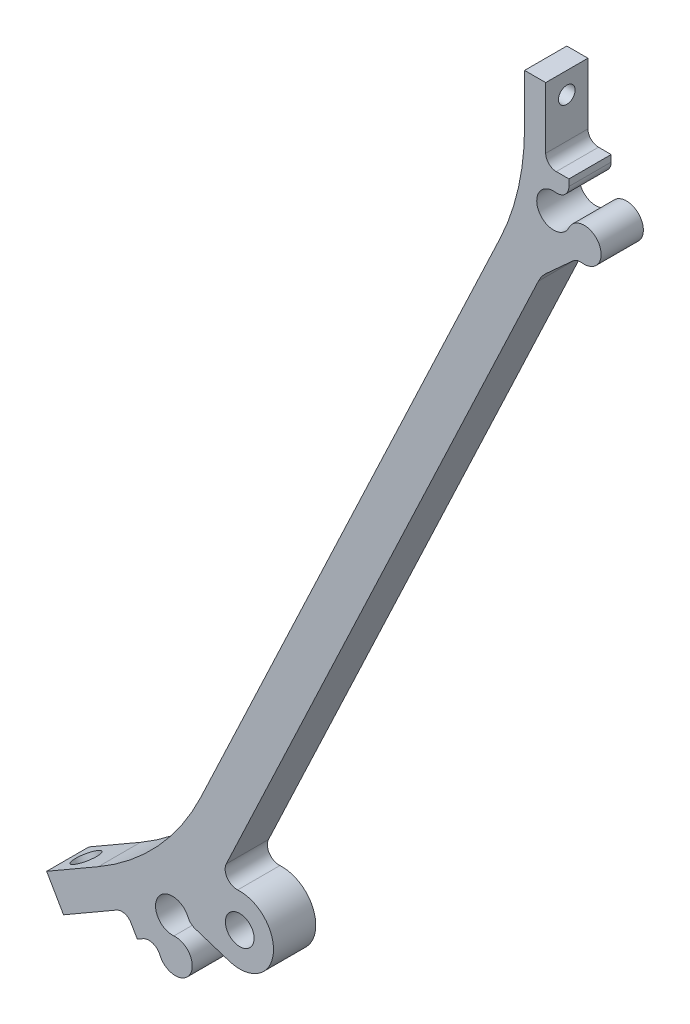
ISO-10303-21;
HEADER;
FILE_DESCRIPTION(('STEP AP214'),'2;1');
FILE_NAME('part.step','',(''),(''),'','','');
FILE_SCHEMA(('AUTOMOTIVE_DESIGN { 1 0 10303 214 1 1 1 1 }'));
ENDSEC;
DATA;
#1=APPLICATION_CONTEXT('core data for automotive mechanical design processes');
#2=APPLICATION_PROTOCOL_DEFINITION('international standard','automotive_design',2000,#1);
#3=PRODUCT_CONTEXT('',#1,'mechanical');
#4=PRODUCT('Part','Part','',(#3));
#5=PRODUCT_RELATED_PRODUCT_CATEGORY('part','',(#4));
#6=PRODUCT_DEFINITION_FORMATION('','',#4);
#7=PRODUCT_DEFINITION_CONTEXT('part definition',#1,'design');
#8=PRODUCT_DEFINITION('design','',#6,#7);
#9=PRODUCT_DEFINITION_SHAPE('','',#8);
#10=(LENGTH_UNIT() NAMED_UNIT(*) SI_UNIT(.MILLI.,.METRE.));
#11=(NAMED_UNIT(*) PLANE_ANGLE_UNIT() SI_UNIT($,.RADIAN.));
#12=(NAMED_UNIT(*) SI_UNIT($,.STERADIAN.) SOLID_ANGLE_UNIT());
#13=UNCERTAINTY_MEASURE_WITH_UNIT(LENGTH_MEASURE(1.E-05),#10,'distance_accuracy_value','');
#14=(GEOMETRIC_REPRESENTATION_CONTEXT(3) GLOBAL_UNCERTAINTY_ASSIGNED_CONTEXT((#13)) GLOBAL_UNIT_ASSIGNED_CONTEXT((#10,
#11,#12)) REPRESENTATION_CONTEXT('',''));
#15=CARTESIAN_POINT('',(0.,0.,0.));
#16=DIRECTION('',(0.,0.,1.));
#17=DIRECTION('',(1.,0.,0.));
#18=AXIS2_PLACEMENT_3D('',#15,#16,#17);
#19=CARTESIAN_POINT('',(28.6750898602138,32.7620342253304,6.35));
#20=DIRECTION('',(0.,0.,-1.));
#21=DIRECTION('',(-1.,0.,0.));
#22=AXIS2_PLACEMENT_3D('',#19,#20,#21);
#23=PLANE('',#22);
#24=DIRECTION('',(0.499999999999981,-0.866025403784449,0.));
#25=VECTOR('',#24,1.);
#26=CARTESIAN_POINT('',(13.2947222605792,35.8339027739446,6.35));
#27=LINE('',#26,#25);
#28=CARTESIAN_POINT('',(13.2947222605792,35.8339027739446,6.35));
#29=VERTEX_POINT('',#28);
#30=CARTESIAN_POINT('',(15.8347222605791,31.4344937227196,6.35));
#31=VERTEX_POINT('',#30);
#32=EDGE_CURVE('E236',#29,#31,#27,.T.);
#33=ORIENTED_EDGE('',*,*,#32,.T.);
#34=DIRECTION('',(0.86602540378445,0.499999999999981,0.));
#35=VECTOR('',#34,1.);
#36=CARTESIAN_POINT('',(15.8347222605791,31.4344937227196,6.35));
#37=LINE('',#36,#35);
#38=CARTESIAN_POINT('',(23.8086511659251,36.0382437227198,6.35));
#39=VERTEX_POINT('',#38);
#40=EDGE_CURVE('E225',#31,#39,#37,.T.);
#41=ORIENTED_EDGE('',*,*,#40,.T.);
#42=CARTESIAN_POINT('',(24.602401165925,34.663428394212,6.35));
#43=DIRECTION('',(0.,0.,-1.));
#44=DIRECTION('',(-1.,0.,0.));
#45=AXIS2_PLACEMENT_3D('',#42,#43,#44);
#46=CIRCLE('',#45,1.5875);
#47=CARTESIAN_POINT('',(25.9772164944332,35.4571783942114,6.35));
#48=VERTEX_POINT('',#47);
#49=EDGE_CURVE('E272',#39,#48,#46,.T.);
#50=ORIENTED_EDGE('',*,*,#49,.T.);
#51=DIRECTION('',(0.499999999999635,-0.866025403784649,0.));
#52=VECTOR('',#51,1.);
#53=CARTESIAN_POINT('',(25.1834664944334,36.8319937227201,6.35));
#54=LINE('',#53,#52);
#55=CARTESIAN_POINT('',(26.9297164944322,33.807400000002,6.35));
#56=VERTEX_POINT('',#55);
#57=EDGE_CURVE('E235',#48,#56,#54,.T.);
#58=ORIENTED_EDGE('',*,*,#57,.T.);
#59=DIRECTION('',(0.866025403784449,0.499999999999982,0.));
#60=VECTOR('',#59,1.);
#61=CARTESIAN_POINT('',(26.9297164944322,33.807400000002,6.35));
#62=LINE('',#61,#60);
#63=CARTESIAN_POINT('',(27.7860898602124,34.301827393262,6.35));
#64=VERTEX_POINT('',#63);
#65=EDGE_CURVE('E858',#56,#64,#62,.T.);
#66=ORIENTED_EDGE('',*,*,#65,.T.);
#67=CARTESIAN_POINT('',(28.6750898602138,32.7620342253304,6.35));
#68=DIRECTION('',(0.,0.,-1.));
#69=DIRECTION('',(-1.,0.,0.));
#70=AXIS2_PLACEMENT_3D('',#67,#68,#69);
#71=CIRCLE('',#70,1.77800000000325);
#72=CARTESIAN_POINT('',(30.3112736731325,33.45786935692,6.35));
#73=VERTEX_POINT('',#72);
#74=EDGE_CURVE('E418',#64,#73,#71,.T.);
#75=ORIENTED_EDGE('',*,*,#74,.T.);
#76=CARTESIAN_POINT('',(32.6486791201546,34.451919544903,6.35));
#77=DIRECTION('',(0.,0.,1.));
#78=DIRECTION('',(1.,0.,0.));
#79=AXIS2_PLACEMENT_3D('',#76,#77,#78);
#80=CIRCLE('',#79,2.53999999999941);
#81=CARTESIAN_POINT('',(32.4289778084637,36.982400000002,6.35));
#82=VERTEX_POINT('',#81);
#83=EDGE_CURVE('E437',#73,#82,#80,.T.);
#84=ORIENTED_EDGE('',*,*,#83,.T.);
#85=CARTESIAN_POINT('',(32.2092764967728,39.5128804551011,6.35));
#86=DIRECTION('',(0.,0.,-1.));
#87=DIRECTION('',(1.,0.,0.));
#88=AXIS2_PLACEMENT_3D('',#85,#86,#87);
#89=CIRCLE('',#88,2.53999999999941);
#90=CARTESIAN_POINT('',(34.5466819437948,40.5069306430841,6.35));
#91=VERTEX_POINT('',#90);
#92=EDGE_CURVE('E434',#82,#91,#89,.T.);
#93=ORIENTED_EDGE('',*,*,#92,.T.);
#94=CARTESIAN_POINT('',(36.1828657567133,41.2027657746735,6.35));
#95=DIRECTION('',(0.,0.,1.));
#96=DIRECTION('',(1.,0.,0.));
#97=AXIS2_PLACEMENT_3D('',#94,#95,#96);
#98=CIRCLE('',#97,1.77800000000308);
#99=CARTESIAN_POINT('',(35.6391876912389,39.5099284637859,6.35));
#100=VERTEX_POINT('',#99);
#101=EDGE_CURVE('E436',#91,#100,#98,.T.);
#102=ORIENTED_EDGE('',*,*,#101,.T.);
#103=DIRECTION('',(0.952101974625759,-0.305780689242684,0.));
#104=VECTOR('',#103,1.);
#105=CARTESIAN_POINT('',(35.6391876912389,39.5099284637859,6.35));
#106=LINE('',#105,#104);
#107=CARTESIAN_POINT('',(40.774282272367,37.8607219689029,6.35));
#108=VERTEX_POINT('',#107);
#109=EDGE_CURVE('E439',#100,#108,#106,.T.);
#110=ORIENTED_EDGE('',*,*,#109,.T.);
#111=CARTESIAN_POINT('',(42.3276481737198,42.6974000000017,6.35));
#112=DIRECTION('',(0.,0.,1.));
#113=DIRECTION('',(1.,0.,0.));
#114=AXIS2_PLACEMENT_3D('',#111,#112,#113);
#115=CIRCLE('',#114,5.08000000000002);
#116=CARTESIAN_POINT('',(42.0177686217037,47.7679398788748,6.35));
#117=VERTEX_POINT('',#116);
#118=EDGE_CURVE('E445',#108,#117,#115,.T.);
#119=ORIENTED_EDGE('',*,*,#118,.T.);
#120=CARTESIAN_POINT('',(41.909310778498,49.5426288364804,6.35));
#121=DIRECTION('',(0.,0.,-1.));
#122=DIRECTION('',(1.,0.,0.));
#123=AXIS2_PLACEMENT_3D('',#120,#121,#122);
#124=CIRCLE('',#123,1.778);
#125=CARTESIAN_POINT('',(40.301653081639,50.302050148882,6.35));
#126=VERTEX_POINT('',#125);
#127=EDGE_CURVE('E447',#117,#126,#124,.T.);
#128=ORIENTED_EDGE('',*,*,#127,.T.);
#129=DIRECTION('',(0.427121098088627,0.904194430179464,0.));
#130=VECTOR('',#129,1.);
#131=CARTESIAN_POINT('',(40.301653081639,50.302050148882,6.35));
#132=LINE('',#131,#130);
#133=CARTESIAN_POINT('',(87.2276922946883,149.64217517829,6.35));
#134=VERTEX_POINT('',#133);
#135=EDGE_CURVE('E449',#126,#134,#132,.T.);
#136=ORIENTED_EDGE('',*,*,#135,.T.);
#137=CARTESIAN_POINT('',(91.821,147.4724,6.35));
#138=DIRECTION('',(0.,0.,-1.));
#139=DIRECTION('',(-1.,0.,0.));
#140=AXIS2_PLACEMENT_3D('',#137,#138,#139);
#141=CIRCLE('',#140,5.07999999999999);
#142=CARTESIAN_POINT('',(88.4089969058181,151.235993347493,6.35));
#143=VERTEX_POINT('',#142);
#144=EDGE_CURVE('E451',#134,#143,#141,.T.);
#145=ORIENTED_EDGE('',*,*,#144,.T.);
#146=DIRECTION('',(0.740864832183645,0.671654152398018,0.));
#147=VECTOR('',#146,1.);
#148=CARTESIAN_POINT('',(92.4047989170363,154.858512458145,6.35));
#149=LINE('',#148,#147);
#150=CARTESIAN_POINT('',(92.4047989170363,154.858512458145,6.35));
#151=VERTEX_POINT('',#150);
#152=EDGE_CURVE('E453',#143,#151,#149,.T.);
#153=ORIENTED_EDGE('',*,*,#152,.T.);
#154=CARTESIAN_POINT('',(93.599,153.541254786522,6.35));
#155=DIRECTION('',(0.,0.,-1.));
#156=DIRECTION('',(1.,0.,0.));
#157=AXIS2_PLACEMENT_3D('',#154,#155,#156);
#158=CIRCLE('',#157,1.77800000000003);
#159=CARTESIAN_POINT('',(93.814481005658,155.306149099562,6.35));
#160=VERTEX_POINT('',#159);
#161=EDGE_CURVE('E455',#151,#160,#158,.T.);
#162=ORIENTED_EDGE('',*,*,#161,.T.);
#163=CARTESIAN_POINT('',(94.1223110137408,157.827426689619,6.35));
#164=DIRECTION('',(0.,0.,1.));
#165=DIRECTION('',(1.,0.,0.));
#166=AXIS2_PLACEMENT_3D('',#163,#164,#165);
#167=CIRCLE('',#166,2.53999999999943);
#168=CARTESIAN_POINT('',(91.821,158.9024,6.35));
#169=VERTEX_POINT('',#168);
#170=EDGE_CURVE('E457',#160,#169,#167,.T.);
#171=ORIENTED_EDGE('',*,*,#170,.T.);
#172=CARTESIAN_POINT('',(89.5196889862593,159.977373310381,6.35));
#173=DIRECTION('',(0.,0.,-1.));
#174=DIRECTION('',(1.,0.,0.));
#175=AXIS2_PLACEMENT_3D('',#172,#173,#174);
#176=CIRCLE('',#175,2.5399999999994);
#177=CARTESIAN_POINT('',(89.827518994342,162.498650900438,6.35));
#178=VERTEX_POINT('',#177);
#179=EDGE_CURVE('E459',#169,#178,#176,.T.);
#180=ORIENTED_EDGE('',*,*,#179,.T.);
#181=CARTESIAN_POINT('',(90.043,164.263545213478,6.35));
#182=DIRECTION('',(0.,0.,1.));
#183=DIRECTION('',(-1.,0.,0.));
#184=AXIS2_PLACEMENT_3D('',#181,#182,#183);
#185=CIRCLE('',#184,1.778);
#186=CARTESIAN_POINT('',(91.821,164.263545213478,6.35));
#187=VERTEX_POINT('',#186);
#188=EDGE_CURVE('E461',#178,#187,#185,.T.);
#189=ORIENTED_EDGE('',*,*,#188,.T.);
#190=DIRECTION('',(0.,1.,0.));
#191=VECTOR('',#190,1.);
#192=CARTESIAN_POINT('',(91.821,165.2524,6.35));
#193=LINE('',#192,#191);
#194=CARTESIAN_POINT('',(91.821,165.2524,6.35));
#195=VERTEX_POINT('',#194);
#196=EDGE_CURVE('E463',#187,#195,#193,.T.);
#197=ORIENTED_EDGE('',*,*,#196,.T.);
#198=DIRECTION('',(-1.,0.,0.));
#199=VECTOR('',#198,1.);
#200=CARTESIAN_POINT('',(91.821,165.2524,6.35));
#201=LINE('',#200,#199);
#202=CARTESIAN_POINT('',(89.916,165.2524,6.35));
#203=VERTEX_POINT('',#202);
#204=EDGE_CURVE('E465',#195,#203,#201,.T.);
#205=ORIENTED_EDGE('',*,*,#204,.T.);
#206=CARTESIAN_POINT('',(89.916,166.8399,6.35));
#207=DIRECTION('',(0.,0.,-1.));
#208=DIRECTION('',(-1.,0.,0.));
#209=AXIS2_PLACEMENT_3D('',#206,#207,#208);
#210=CIRCLE('',#209,1.5875);
#211=CARTESIAN_POINT('',(88.3285,166.8399,6.35));
#212=VERTEX_POINT('',#211);
#213=EDGE_CURVE('E276',#203,#212,#210,.T.);
#214=ORIENTED_EDGE('',*,*,#213,.T.);
#215=DIRECTION('',(0.,1.,0.));
#216=VECTOR('',#215,1.);
#217=CARTESIAN_POINT('',(88.3285,165.2524,6.35));
#218=LINE('',#217,#216);
#219=CARTESIAN_POINT('',(88.3285,176.0474,6.35));
#220=VERTEX_POINT('',#219);
#221=EDGE_CURVE('E468',#212,#220,#218,.T.);
#222=ORIENTED_EDGE('',*,*,#221,.T.);
#223=DIRECTION('',(-1.,0.,0.));
#224=VECTOR('',#223,1.);
#225=CARTESIAN_POINT('',(88.3285,176.0474,6.35));
#226=LINE('',#225,#224);
#227=CARTESIAN_POINT('',(85.1535,176.0474,6.35));
#228=VERTEX_POINT('',#227);
#229=EDGE_CURVE('E470',#220,#228,#226,.T.);
#230=ORIENTED_EDGE('',*,*,#229,.T.);
#231=DIRECTION('',(0.,-1.,0.));
#232=VECTOR('',#231,1.);
#233=CARTESIAN_POINT('',(85.1535,176.0474,6.35));
#234=LINE('',#233,#232);
#235=CARTESIAN_POINT('',(85.1535,168.664225661262,6.35));
#236=VERTEX_POINT('',#235);
#237=EDGE_CURVE('E310',#228,#236,#234,.T.);
#238=ORIENTED_EDGE('',*,*,#237,.T.);
#239=CARTESIAN_POINT('',(47.0535,168.664225661262,6.35));
#240=DIRECTION('',(0.,0.,-1.));
#241=DIRECTION('',(-1.,0.,0.));
#242=AXIS2_PLACEMENT_3D('',#239,#240,#241);
#243=CIRCLE('',#242,38.1);
#244=CARTESIAN_POINT('',(81.5033077898376,152.390911824085,6.35));
#245=VERTEX_POINT('',#244);
#246=EDGE_CURVE('E289',#236,#245,#243,.T.);
#247=ORIENTED_EDGE('',*,*,#246,.T.);
#248=DIRECTION('',(-0.427121098088627,-0.904194430179464,0.));
#249=VECTOR('',#248,1.);
#250=CARTESIAN_POINT('',(85.1535,160.118189826233,6.35));
#251=LINE('',#250,#249);
#252=CARTESIAN_POINT('',(36.4620239321402,57.0407215044967,6.35));
#253=VERTEX_POINT('',#252);
#254=EDGE_CURVE('E306',#245,#253,#251,.T.);
#255=ORIENTED_EDGE('',*,*,#254,.T.);
#256=CARTESIAN_POINT('',(2.01221614230267,73.3140353416733,6.35));
#257=DIRECTION('',(0.,0.,-1.));
#258=DIRECTION('',(-1.,0.,0.));
#259=AXIS2_PLACEMENT_3D('',#256,#257,#258);
#260=CIRCLE('',#259,38.1);
#261=CARTESIAN_POINT('',(21.062216142302,40.3184674574858,6.35));
#262=VERTEX_POINT('',#261);
#263=EDGE_CURVE('E11',#253,#262,#260,.T.);
#264=ORIENTED_EDGE('',*,*,#263,.T.);
#265=DIRECTION('',(-0.866025403784449,-0.499999999999981,0.));
#266=VECTOR('',#265,1.);
#267=CARTESIAN_POINT('',(31.375529243393,46.2728615526373,6.35));
#268=LINE('',#267,#266);
#269=EDGE_CURVE('E240',#262,#29,#268,.T.);
#270=ORIENTED_EDGE('',*,*,#269,.T.);
#271=EDGE_LOOP('',(#33,#41,#50,#58,#66,#75,#84,#93,#102,#110,#119,#128,#136,#145,#153,#162,#171,
#180,#189,#197,#205,#214,#222,#230,#238,#247,#255,#264,#270));
#272=FACE_BOUND('',#271,.T.);
#273=CARTESIAN_POINT('',(42.3276481737198,42.6974000000017,6.35));
#274=DIRECTION('',(0.,0.,1.));
#275=DIRECTION('',(1.,0.,0.));
#276=AXIS2_PLACEMENT_3D('',#273,#274,#275);
#277=CIRCLE('',#276,2.159);
#278=CARTESIAN_POINT('',(44.4866481737198,42.6974000000017,6.35));
#279=VERTEX_POINT('',#278);
#280=EDGE_CURVE('E316',#279,#279,#277,.T.);
#281=ORIENTED_EDGE('',*,*,#280,.F.);
#282=EDGE_LOOP('',(#281));
#283=FACE_BOUND('',#282,.T.);
#284=ADVANCED_FACE('F35',(#272,#283),#23,.F.);
#285=CARTESIAN_POINT('',(28.6750898602138,32.7620342253304,0.));
#286=DIRECTION('',(0.,0.,-1.));
#287=DIRECTION('',(-1.,0.,0.));
#288=AXIS2_PLACEMENT_3D('',#285,#286,#287);
#289=PLANE('',#288);
#290=DIRECTION('',(0.499999999999981,-0.866025403784449,0.));
#291=VECTOR('',#290,1.);
#292=CARTESIAN_POINT('',(13.2947222605792,35.8339027739446,0.));
#293=LINE('',#292,#291);
#294=CARTESIAN_POINT('',(13.2947222605792,35.8339027739446,0.));
#295=VERTEX_POINT('',#294);
#296=CARTESIAN_POINT('',(15.8347222605791,31.4344937227196,0.));
#297=VERTEX_POINT('',#296);
#298=EDGE_CURVE('E248',#295,#297,#293,.T.);
#299=ORIENTED_EDGE('',*,*,#298,.F.);
#300=DIRECTION('',(-0.866025403784449,-0.499999999999981,0.));
#301=VECTOR('',#300,1.);
#302=CARTESIAN_POINT('',(31.375529243393,46.2728615526373,0.));
#303=LINE('',#302,#301);
#304=CARTESIAN_POINT('',(21.062216142302,40.3184674574858,0.));
#305=VERTEX_POINT('',#304);
#306=EDGE_CURVE('E244',#305,#295,#303,.T.);
#307=ORIENTED_EDGE('',*,*,#306,.F.);
#308=CARTESIAN_POINT('',(2.01221614230267,73.3140353416733,0.));
#309=DIRECTION('',(0.,0.,-1.));
#310=DIRECTION('',(-1.,0.,0.));
#311=AXIS2_PLACEMENT_3D('',#308,#309,#310);
#312=CIRCLE('',#311,38.1);
#313=CARTESIAN_POINT('',(36.4620239321402,57.0407215044967,0.));
#314=VERTEX_POINT('',#313);
#315=EDGE_CURVE('E43',#305,#314,#312,.F.);
#316=ORIENTED_EDGE('',*,*,#315,.T.);
#317=DIRECTION('',(-0.427121098088627,-0.904194430179464,0.));
#318=VECTOR('',#317,1.);
#319=CARTESIAN_POINT('',(85.1535,160.118189826233,0.));
#320=LINE('',#319,#318);
#321=CARTESIAN_POINT('',(81.5033077898376,152.390911824085,0.));
#322=VERTEX_POINT('',#321);
#323=EDGE_CURVE('E296',#322,#314,#320,.T.);
#324=ORIENTED_EDGE('',*,*,#323,.F.);
#325=CARTESIAN_POINT('',(47.0535,168.664225661262,0.));
#326=DIRECTION('',(0.,0.,-1.));
#327=DIRECTION('',(-1.,0.,0.));
#328=AXIS2_PLACEMENT_3D('',#325,#326,#327);
#329=CIRCLE('',#328,38.1);
#330=CARTESIAN_POINT('',(85.1535,168.664225661262,0.));
#331=VERTEX_POINT('',#330);
#332=EDGE_CURVE('E287',#322,#331,#329,.F.);
#333=ORIENTED_EDGE('',*,*,#332,.T.);
#334=DIRECTION('',(0.,-1.,0.));
#335=VECTOR('',#334,1.);
#336=CARTESIAN_POINT('',(85.1535,176.0474,0.));
#337=LINE('',#336,#335);
#338=CARTESIAN_POINT('',(85.1535,176.0474,0.));
#339=VERTEX_POINT('',#338);
#340=EDGE_CURVE('E301',#339,#331,#337,.T.);
#341=ORIENTED_EDGE('',*,*,#340,.F.);
#342=DIRECTION('',(-1.,0.,0.));
#343=VECTOR('',#342,1.);
#344=CARTESIAN_POINT('',(88.3285,176.0474,0.));
#345=LINE('',#344,#343);
#346=CARTESIAN_POINT('',(88.3285,176.0474,0.));
#347=VERTEX_POINT('',#346);
#348=EDGE_CURVE('E357',#347,#339,#345,.T.);
#349=ORIENTED_EDGE('',*,*,#348,.F.);
#350=DIRECTION('',(0.,1.,0.));
#351=VECTOR('',#350,1.);
#352=CARTESIAN_POINT('',(88.3285,165.2524,0.));
#353=LINE('',#352,#351);
#354=CARTESIAN_POINT('',(88.3285,166.8399,0.));
#355=VERTEX_POINT('',#354);
#356=EDGE_CURVE('E355',#355,#347,#353,.T.);
#357=ORIENTED_EDGE('',*,*,#356,.F.);
#358=CARTESIAN_POINT('',(89.916,166.8399,0.));
#359=DIRECTION('',(0.,0.,-1.));
#360=DIRECTION('',(-1.,0.,0.));
#361=AXIS2_PLACEMENT_3D('',#358,#359,#360);
#362=CIRCLE('',#361,1.5875);
#363=CARTESIAN_POINT('',(89.916,165.2524,0.));
#364=VERTEX_POINT('',#363);
#365=EDGE_CURVE('E274',#355,#364,#362,.F.);
#366=ORIENTED_EDGE('',*,*,#365,.T.);
#367=DIRECTION('',(-1.,0.,0.));
#368=VECTOR('',#367,1.);
#369=CARTESIAN_POINT('',(91.821,165.2524,0.));
#370=LINE('',#369,#368);
#371=CARTESIAN_POINT('',(91.821,165.2524,0.));
#372=VERTEX_POINT('',#371);
#373=EDGE_CURVE('E352',#372,#364,#370,.T.);
#374=ORIENTED_EDGE('',*,*,#373,.F.);
#375=DIRECTION('',(0.,1.,0.));
#376=VECTOR('',#375,1.);
#377=CARTESIAN_POINT('',(91.821,165.2524,0.));
#378=LINE('',#377,#376);
#379=CARTESIAN_POINT('',(91.821,164.263545213478,0.));
#380=VERTEX_POINT('',#379);
#381=EDGE_CURVE('E350',#380,#372,#378,.T.);
#382=ORIENTED_EDGE('',*,*,#381,.F.);
#383=CARTESIAN_POINT('',(90.043,164.263545213478,0.));
#384=DIRECTION('',(0.,0.,1.));
#385=DIRECTION('',(-1.,0.,0.));
#386=AXIS2_PLACEMENT_3D('',#383,#384,#385);
#387=CIRCLE('',#386,1.778);
#388=CARTESIAN_POINT('',(89.827518994342,162.498650900438,0.));
#389=VERTEX_POINT('',#388);
#390=EDGE_CURVE('E348',#389,#380,#387,.T.);
#391=ORIENTED_EDGE('',*,*,#390,.F.);
#392=CARTESIAN_POINT('',(89.5196889862593,159.977373310381,0.));
#393=DIRECTION('',(0.,0.,-1.));
#394=DIRECTION('',(1.,0.,0.));
#395=AXIS2_PLACEMENT_3D('',#392,#393,#394);
#396=CIRCLE('',#395,2.5399999999994);
#397=CARTESIAN_POINT('',(91.821,158.9024,0.));
#398=VERTEX_POINT('',#397);
#399=EDGE_CURVE('E346',#398,#389,#396,.T.);
#400=ORIENTED_EDGE('',*,*,#399,.F.);
#401=CARTESIAN_POINT('',(94.1223110137408,157.827426689619,0.));
#402=DIRECTION('',(0.,0.,1.));
#403=DIRECTION('',(1.,0.,0.));
#404=AXIS2_PLACEMENT_3D('',#401,#402,#403);
#405=CIRCLE('',#404,2.53999999999943);
#406=CARTESIAN_POINT('',(93.814481005658,155.306149099562,0.));
#407=VERTEX_POINT('',#406);
#408=EDGE_CURVE('E344',#407,#398,#405,.T.);
#409=ORIENTED_EDGE('',*,*,#408,.F.);
#410=CARTESIAN_POINT('',(93.599,153.541254786522,0.));
#411=DIRECTION('',(0.,0.,-1.));
#412=DIRECTION('',(1.,0.,0.));
#413=AXIS2_PLACEMENT_3D('',#410,#411,#412);
#414=CIRCLE('',#413,1.77800000000003);
#415=CARTESIAN_POINT('',(92.4047989170363,154.858512458145,0.));
#416=VERTEX_POINT('',#415);
#417=EDGE_CURVE('E342',#416,#407,#414,.T.);
#418=ORIENTED_EDGE('',*,*,#417,.F.);
#419=DIRECTION('',(0.740864832183645,0.671654152398018,0.));
#420=VECTOR('',#419,1.);
#421=CARTESIAN_POINT('',(92.4047989170363,154.858512458145,0.));
#422=LINE('',#421,#420);
#423=CARTESIAN_POINT('',(88.4089969058181,151.235993347493,0.));
#424=VERTEX_POINT('',#423);
#425=EDGE_CURVE('E340',#424,#416,#422,.T.);
#426=ORIENTED_EDGE('',*,*,#425,.F.);
#427=CARTESIAN_POINT('',(91.821,147.4724,0.));
#428=DIRECTION('',(0.,0.,-1.));
#429=DIRECTION('',(-1.,0.,0.));
#430=AXIS2_PLACEMENT_3D('',#427,#428,#429);
#431=CIRCLE('',#430,5.07999999999999);
#432=CARTESIAN_POINT('',(87.2276922946883,149.64217517829,0.));
#433=VERTEX_POINT('',#432);
#434=EDGE_CURVE('E338',#433,#424,#431,.T.);
#435=ORIENTED_EDGE('',*,*,#434,.F.);
#436=DIRECTION('',(0.427121098088627,0.904194430179464,0.));
#437=VECTOR('',#436,1.);
#438=CARTESIAN_POINT('',(40.301653081639,50.302050148882,0.));
#439=LINE('',#438,#437);
#440=CARTESIAN_POINT('',(40.301653081639,50.302050148882,0.));
#441=VERTEX_POINT('',#440);
#442=EDGE_CURVE('E336',#441,#433,#439,.T.);
#443=ORIENTED_EDGE('',*,*,#442,.F.);
#444=CARTESIAN_POINT('',(41.909310778498,49.5426288364804,0.));
#445=DIRECTION('',(0.,0.,-1.));
#446=DIRECTION('',(1.,0.,0.));
#447=AXIS2_PLACEMENT_3D('',#444,#445,#446);
#448=CIRCLE('',#447,1.778);
#449=CARTESIAN_POINT('',(42.0177686217037,47.7679398788748,0.));
#450=VERTEX_POINT('',#449);
#451=EDGE_CURVE('E334',#450,#441,#448,.T.);
#452=ORIENTED_EDGE('',*,*,#451,.F.);
#453=CARTESIAN_POINT('',(42.3276481737198,42.6974000000017,0.));
#454=DIRECTION('',(0.,0.,1.));
#455=DIRECTION('',(1.,0.,0.));
#456=AXIS2_PLACEMENT_3D('',#453,#454,#455);
#457=CIRCLE('',#456,5.08000000000002);
#458=CARTESIAN_POINT('',(40.774282272367,37.8607219689029,0.));
#459=VERTEX_POINT('',#458);
#460=EDGE_CURVE('E332',#459,#450,#457,.T.);
#461=ORIENTED_EDGE('',*,*,#460,.F.);
#462=DIRECTION('',(0.952101974625759,-0.305780689242684,0.));
#463=VECTOR('',#462,1.);
#464=CARTESIAN_POINT('',(35.6391876912389,39.5099284637859,0.));
#465=LINE('',#464,#463);
#466=CARTESIAN_POINT('',(35.6391876912389,39.5099284637859,0.));
#467=VERTEX_POINT('',#466);
#468=EDGE_CURVE('E330',#467,#459,#465,.T.);
#469=ORIENTED_EDGE('',*,*,#468,.F.);
#470=CARTESIAN_POINT('',(36.1828657567133,41.2027657746735,0.));
#471=DIRECTION('',(0.,0.,1.));
#472=DIRECTION('',(1.,0.,0.));
#473=AXIS2_PLACEMENT_3D('',#470,#471,#472);
#474=CIRCLE('',#473,1.77800000000308);
#475=CARTESIAN_POINT('',(34.5466819437948,40.5069306430841,0.));
#476=VERTEX_POINT('',#475);
#477=EDGE_CURVE('E328',#476,#467,#474,.T.);
#478=ORIENTED_EDGE('',*,*,#477,.F.);
#479=CARTESIAN_POINT('',(32.2092764967728,39.5128804551011,0.));
#480=DIRECTION('',(0.,0.,-1.));
#481=DIRECTION('',(1.,0.,0.));
#482=AXIS2_PLACEMENT_3D('',#479,#480,#481);
#483=CIRCLE('',#482,2.53999999999941);
#484=CARTESIAN_POINT('',(32.4289778084637,36.982400000002,0.));
#485=VERTEX_POINT('',#484);
#486=EDGE_CURVE('E326',#485,#476,#483,.T.);
#487=ORIENTED_EDGE('',*,*,#486,.F.);
#488=CARTESIAN_POINT('',(32.6486791201546,34.451919544903,0.));
#489=DIRECTION('',(0.,0.,1.));
#490=DIRECTION('',(1.,0.,0.));
#491=AXIS2_PLACEMENT_3D('',#488,#489,#490);
#492=CIRCLE('',#491,2.53999999999941);
#493=CARTESIAN_POINT('',(30.3112736731325,33.45786935692,0.));
#494=VERTEX_POINT('',#493);
#495=EDGE_CURVE('E324',#494,#485,#492,.T.);
#496=ORIENTED_EDGE('',*,*,#495,.F.);
#497=CARTESIAN_POINT('',(28.6750898602138,32.7620342253304,0.));
#498=DIRECTION('',(0.,0.,-1.));
#499=DIRECTION('',(-1.,0.,0.));
#500=AXIS2_PLACEMENT_3D('',#497,#498,#499);
#501=CIRCLE('',#500,1.77800000000325);
#502=CARTESIAN_POINT('',(27.7860898602124,34.301827393262,0.));
#503=VERTEX_POINT('',#502);
#504=EDGE_CURVE('E322',#503,#494,#501,.T.);
#505=ORIENTED_EDGE('',*,*,#504,.F.);
#506=DIRECTION('',(0.866025403784449,0.499999999999982,0.));
#507=VECTOR('',#506,1.);
#508=CARTESIAN_POINT('',(26.9297164944322,33.807400000002,0.));
#509=LINE('',#508,#507);
#510=CARTESIAN_POINT('',(26.9297164944322,33.807400000002,0.));
#511=VERTEX_POINT('',#510);
#512=EDGE_CURVE('E320',#511,#503,#509,.T.);
#513=ORIENTED_EDGE('',*,*,#512,.F.);
#514=DIRECTION('',(0.499999999999635,-0.866025403784649,0.));
#515=VECTOR('',#514,1.);
#516=CARTESIAN_POINT('',(25.1834664944334,36.8319937227201,0.));
#517=LINE('',#516,#515);
#518=CARTESIAN_POINT('',(25.9772164944332,35.4571783942114,0.));
#519=VERTEX_POINT('',#518);
#520=EDGE_CURVE('E318',#519,#511,#517,.T.);
#521=ORIENTED_EDGE('',*,*,#520,.F.);
#522=CARTESIAN_POINT('',(24.602401165925,34.663428394212,0.));
#523=DIRECTION('',(0.,0.,-1.));
#524=DIRECTION('',(-1.,0.,0.));
#525=AXIS2_PLACEMENT_3D('',#522,#523,#524);
#526=CIRCLE('',#525,1.5875);
#527=CARTESIAN_POINT('',(23.8086511659251,36.0382437227198,0.));
#528=VERTEX_POINT('',#527);
#529=EDGE_CURVE('E270',#519,#528,#526,.F.);
#530=ORIENTED_EDGE('',*,*,#529,.T.);
#531=DIRECTION('',(0.86602540378445,0.499999999999981,0.));
#532=VECTOR('',#531,1.);
#533=CARTESIAN_POINT('',(15.8347222605791,31.4344937227196,0.));
#534=LINE('',#533,#532);
#535=EDGE_CURVE('E315',#297,#528,#534,.T.);
#536=ORIENTED_EDGE('',*,*,#535,.F.);
#537=EDGE_LOOP('',(#299,#307,#316,#324,#333,#341,#349,#357,#366,#374,#382,#391,#400,#409,#418,
#426,#435,#443,#452,#461,#469,#478,#487,#496,#505,#513,#521,#530,#536));
#538=FACE_BOUND('',#537,.T.);
#539=CARTESIAN_POINT('',(42.3276481737198,42.6974000000017,0.));
#540=DIRECTION('',(0.,0.,1.));
#541=DIRECTION('',(1.,0.,0.));
#542=AXIS2_PLACEMENT_3D('',#539,#540,#541);
#543=CIRCLE('',#542,2.159);
#544=CARTESIAN_POINT('',(44.4866481737198,42.6974000000017,0.));
#545=VERTEX_POINT('',#544);
#546=EDGE_CURVE('E261',#545,#545,#543,.T.);
#547=ORIENTED_EDGE('',*,*,#546,.T.);
#548=EDGE_LOOP('',(#547));
#549=FACE_BOUND('',#548,.T.);
#550=ADVANCED_FACE('F294',(#538,#549),#289,.T.);
#551=CARTESIAN_POINT('',(13.2947222605792,35.8339027739446,6.35));
#552=DIRECTION('',(0.866025403784449,0.499999999999981,0.));
#553=DIRECTION('',(-0.499999999999981,0.866025403784449,0.));
#554=AXIS2_PLACEMENT_3D('',#551,#552,#553);
#555=PLANE('',#554);
#556=ORIENTED_EDGE('',*,*,#298,.T.);
#557=DIRECTION('',(0.,0.,-1.));
#558=VECTOR('',#557,1.);
#559=CARTESIAN_POINT('',(15.8347222605791,31.4344937227196,6.35));
#560=LINE('',#559,#558);
#561=EDGE_CURVE('E230',#31,#297,#560,.T.);
#562=ORIENTED_EDGE('',*,*,#561,.F.);
#563=ORIENTED_EDGE('',*,*,#32,.F.);
#564=DIRECTION('',(0.,0.,-1.));
#565=VECTOR('',#564,1.);
#566=CARTESIAN_POINT('',(13.2947222605792,35.8339027739446,6.35));
#567=LINE('',#566,#565);
#568=EDGE_CURVE('E305',#29,#295,#567,.T.);
#569=ORIENTED_EDGE('',*,*,#568,.T.);
#570=EDGE_LOOP('',(#556,#562,#563,#569));
#571=FACE_BOUND('',#570,.T.);
#572=ADVANCED_FACE('F246',(#571),#555,.F.);
#573=CARTESIAN_POINT('',(15.8347222605791,31.4344937227196,6.35));
#574=DIRECTION('',(-0.499999999999981,0.866025403784449,0.));
#575=DIRECTION('',(-0.86602540378445,-0.499999999999981,0.));
#576=AXIS2_PLACEMENT_3D('',#573,#574,#575);
#577=PLANE('',#576);
#578=CARTESIAN_POINT('',(18.5843529175944,33.0219937227201,3.175));
#579=DIRECTION('',(0.499999999999998,-0.86602540378444,0.));
#580=DIRECTION('',(0.86602540378444,0.499999999999998,0.));
#581=AXIS2_PLACEMENT_3D('',#578,#579,#580);
#582=CIRCLE('',#581,1.8288);
#583=CARTESIAN_POINT('',(20.1681401760354,33.9363937227201,3.175));
#584=VERTEX_POINT('',#583);
#585=EDGE_CURVE('E262',#584,#584,#582,.T.);
#586=ORIENTED_EDGE('',*,*,#585,.F.);
#587=EDGE_LOOP('',(#586));
#588=FACE_BOUND('',#587,.T.);
#589=ORIENTED_EDGE('',*,*,#535,.T.);
#590=DIRECTION('',(0.,0.,-1.));
#591=VECTOR('',#590,1.);
#592=CARTESIAN_POINT('',(23.8086511659251,36.0382437227198,6.35));
#593=LINE('',#592,#591);
#594=EDGE_CURVE('E233',#528,#39,#593,.F.);
#595=ORIENTED_EDGE('',*,*,#594,.T.);
#596=ORIENTED_EDGE('',*,*,#40,.F.);
#597=ORIENTED_EDGE('',*,*,#561,.T.);
#598=EDGE_LOOP('',(#589,#595,#596,#597));
#599=FACE_BOUND('',#598,.T.);
#600=ADVANCED_FACE('F228',(#588,#599),#577,.F.);
#601=CARTESIAN_POINT('',(25.1834664944334,36.8319937227201,6.35));
#602=DIRECTION('',(0.866025403784649,0.499999999999635,0.));
#603=DIRECTION('',(-0.499999999999636,0.866025403784649,0.));
#604=AXIS2_PLACEMENT_3D('',#601,#602,#603);
#605=PLANE('',#604);
#606=ORIENTED_EDGE('',*,*,#57,.F.);
#607=DIRECTION('',(0.,0.,-1.));
#608=VECTOR('',#607,1.);
#609=CARTESIAN_POINT('',(25.9772164944332,35.4571783942114,0.));
#610=LINE('',#609,#608);
#611=EDGE_CURVE('E249',#48,#519,#610,.T.);
#612=ORIENTED_EDGE('',*,*,#611,.T.);
#613=ORIENTED_EDGE('',*,*,#520,.T.);
#614=DIRECTION('',(0.,0.,-1.));
#615=VECTOR('',#614,1.);
#616=CARTESIAN_POINT('',(26.9297164944322,33.807400000002,6.35));
#617=LINE('',#616,#615);
#618=EDGE_CURVE('E250',#56,#511,#617,.T.);
#619=ORIENTED_EDGE('',*,*,#618,.F.);
#620=EDGE_LOOP('',(#606,#612,#613,#619));
#621=FACE_BOUND('',#620,.T.);
#622=ADVANCED_FACE('F805',(#621),#605,.F.);
#623=CARTESIAN_POINT('',(26.9297164944322,33.807400000002,6.35));
#624=DIRECTION('',(-0.499999999999982,0.866025403784449,0.));
#625=DIRECTION('',(-0.866025403784449,-0.499999999999982,0.));
#626=AXIS2_PLACEMENT_3D('',#623,#624,#625);
#627=PLANE('',#626);
#628=ORIENTED_EDGE('',*,*,#512,.T.);
#629=DIRECTION('',(0.,0.,-1.));
#630=VECTOR('',#629,1.);
#631=CARTESIAN_POINT('',(27.7860898602124,34.301827393262,6.35));
#632=LINE('',#631,#630);
#633=EDGE_CURVE('E255',#64,#503,#632,.T.);
#634=ORIENTED_EDGE('',*,*,#633,.F.);
#635=ORIENTED_EDGE('',*,*,#65,.F.);
#636=ORIENTED_EDGE('',*,*,#618,.T.);
#637=EDGE_LOOP('',(#628,#634,#635,#636));
#638=FACE_BOUND('',#637,.T.);
#639=ADVANCED_FACE('F797',(#638),#627,.F.);
#640=CARTESIAN_POINT('',(28.6750898602138,32.7620342253304,6.35));
#641=DIRECTION('',(0.,0.,-1.));
#642=DIRECTION('',(-1.,0.,0.));
#643=AXIS2_PLACEMENT_3D('',#640,#641,#642);
#644=CYLINDRICAL_SURFACE('',#643,1.77800000000325);
#645=ORIENTED_EDGE('',*,*,#504,.T.);
#646=DIRECTION('',(0.,0.,-1.));
#647=VECTOR('',#646,1.);
#648=CARTESIAN_POINT('',(30.3112736731325,33.45786935692,6.35));
#649=LINE('',#648,#647);
#650=EDGE_CURVE('E409',#73,#494,#649,.T.);
#651=ORIENTED_EDGE('',*,*,#650,.F.);
#652=ORIENTED_EDGE('',*,*,#74,.F.);
#653=ORIENTED_EDGE('',*,*,#633,.T.);
#654=EDGE_LOOP('',(#645,#651,#652,#653));
#655=FACE_BOUND('',#654,.T.);
#656=ADVANCED_FACE('F416',(#655),#644,.F.);
#657=CARTESIAN_POINT('',(32.6486791201546,34.451919544903,6.35));
#658=DIRECTION('',(0.,0.,-1.));
#659=DIRECTION('',(-1.,0.,0.));
#660=AXIS2_PLACEMENT_3D('',#657,#658,#659);
#661=CYLINDRICAL_SURFACE('',#660,2.53999999999941);
#662=ORIENTED_EDGE('',*,*,#495,.T.);
#663=DIRECTION('',(0.,0.,-1.));
#664=VECTOR('',#663,1.);
#665=CARTESIAN_POINT('',(32.4289778084637,36.982400000002,6.35));
#666=LINE('',#665,#664);
#667=EDGE_CURVE('E406',#82,#485,#666,.T.);
#668=ORIENTED_EDGE('',*,*,#667,.F.);
#669=ORIENTED_EDGE('',*,*,#83,.F.);
#670=ORIENTED_EDGE('',*,*,#650,.T.);
#671=EDGE_LOOP('',(#662,#668,#669,#670));
#672=FACE_BOUND('',#671,.T.);
#673=ADVANCED_FACE('F428',(#672),#661,.T.);
#674=CARTESIAN_POINT('',(32.2092764967728,39.5128804551011,6.35));
#675=DIRECTION('',(0.,0.,-1.));
#676=DIRECTION('',(-1.,0.,0.));
#677=AXIS2_PLACEMENT_3D('',#674,#675,#676);
#678=CYLINDRICAL_SURFACE('',#677,2.53999999999941);
#679=ORIENTED_EDGE('',*,*,#486,.T.);
#680=DIRECTION('',(0.,0.,-1.));
#681=VECTOR('',#680,1.);
#682=CARTESIAN_POINT('',(34.5466819437948,40.5069306430841,6.35));
#683=LINE('',#682,#681);
#684=EDGE_CURVE('E403',#91,#476,#683,.T.);
#685=ORIENTED_EDGE('',*,*,#684,.F.);
#686=ORIENTED_EDGE('',*,*,#92,.F.);
#687=ORIENTED_EDGE('',*,*,#667,.T.);
#688=EDGE_LOOP('',(#679,#685,#686,#687));
#689=FACE_BOUND('',#688,.T.);
#690=ADVANCED_FACE('F432',(#689),#678,.F.);
#691=CARTESIAN_POINT('',(36.1828657567133,41.2027657746735,6.35));
#692=DIRECTION('',(0.,0.,-1.));
#693=DIRECTION('',(-1.,0.,0.));
#694=AXIS2_PLACEMENT_3D('',#691,#692,#693);
#695=CYLINDRICAL_SURFACE('',#694,1.77800000000308);
#696=ORIENTED_EDGE('',*,*,#477,.T.);
#697=DIRECTION('',(0.,0.,-1.));
#698=VECTOR('',#697,1.);
#699=CARTESIAN_POINT('',(35.6391876912389,39.5099284637859,6.35));
#700=LINE('',#699,#698);
#701=EDGE_CURVE('E400',#100,#467,#700,.T.);
#702=ORIENTED_EDGE('',*,*,#701,.F.);
#703=ORIENTED_EDGE('',*,*,#101,.F.);
#704=ORIENTED_EDGE('',*,*,#684,.T.);
#705=EDGE_LOOP('',(#696,#702,#703,#704));
#706=FACE_BOUND('',#705,.T.);
#707=ADVANCED_FACE('F556',(#706),#695,.T.);
#708=CARTESIAN_POINT('',(35.6391876912389,39.5099284637859,6.35));
#709=DIRECTION('',(0.305780689242684,0.952101974625759,0.));
#710=DIRECTION('',(-0.952101974625759,0.305780689242684,0.));
#711=AXIS2_PLACEMENT_3D('',#708,#709,#710);
#712=PLANE('',#711);
#713=ORIENTED_EDGE('',*,*,#468,.T.);
#714=DIRECTION('',(0.,0.,-1.));
#715=VECTOR('',#714,1.);
#716=CARTESIAN_POINT('',(40.774282272367,37.8607219689029,6.35));
#717=LINE('',#716,#715);
#718=EDGE_CURVE('E397',#108,#459,#717,.T.);
#719=ORIENTED_EDGE('',*,*,#718,.F.);
#720=ORIENTED_EDGE('',*,*,#109,.F.);
#721=ORIENTED_EDGE('',*,*,#701,.T.);
#722=EDGE_LOOP('',(#713,#719,#720,#721));
#723=FACE_BOUND('',#722,.T.);
#724=ADVANCED_FACE('F552',(#723),#712,.F.);
#725=CARTESIAN_POINT('',(42.3276481737198,42.6974000000017,6.35));
#726=DIRECTION('',(0.,0.,-1.));
#727=DIRECTION('',(-1.,0.,0.));
#728=AXIS2_PLACEMENT_3D('',#725,#726,#727);
#729=CYLINDRICAL_SURFACE('',#728,5.08000000000002);
#730=ORIENTED_EDGE('',*,*,#460,.T.);
#731=DIRECTION('',(0.,0.,-1.));
#732=VECTOR('',#731,1.);
#733=CARTESIAN_POINT('',(42.0177686217037,47.7679398788748,6.35));
#734=LINE('',#733,#732);
#735=EDGE_CURVE('E394',#117,#450,#734,.T.);
#736=ORIENTED_EDGE('',*,*,#735,.F.);
#737=ORIENTED_EDGE('',*,*,#118,.F.);
#738=ORIENTED_EDGE('',*,*,#718,.T.);
#739=EDGE_LOOP('',(#730,#736,#737,#738));
#740=FACE_BOUND('',#739,.T.);
#741=ADVANCED_FACE('F548',(#740),#729,.T.);
#742=CARTESIAN_POINT('',(41.909310778498,49.5426288364804,6.35));
#743=DIRECTION('',(0.,0.,-1.));
#744=DIRECTION('',(-1.,0.,0.));
#745=AXIS2_PLACEMENT_3D('',#742,#743,#744);
#746=CYLINDRICAL_SURFACE('',#745,1.778);
#747=ORIENTED_EDGE('',*,*,#451,.T.);
#748=DIRECTION('',(0.,0.,-1.));
#749=VECTOR('',#748,1.);
#750=CARTESIAN_POINT('',(40.301653081639,50.302050148882,6.35));
#751=LINE('',#750,#749);
#752=EDGE_CURVE('E391',#126,#441,#751,.T.);
#753=ORIENTED_EDGE('',*,*,#752,.F.);
#754=ORIENTED_EDGE('',*,*,#127,.F.);
#755=ORIENTED_EDGE('',*,*,#735,.T.);
#756=EDGE_LOOP('',(#747,#753,#754,#755));
#757=FACE_BOUND('',#756,.T.);
#758=ADVANCED_FACE('F544',(#757),#746,.F.);
#759=CARTESIAN_POINT('',(40.301653081639,50.302050148882,6.35));
#760=DIRECTION('',(-0.904194430179464,0.427121098088627,0.));
#761=DIRECTION('',(-0.427121098088627,-0.904194430179464,0.));
#762=AXIS2_PLACEMENT_3D('',#759,#760,#761);
#763=PLANE('',#762);
#764=ORIENTED_EDGE('',*,*,#442,.T.);
#765=DIRECTION('',(0.,0.,-1.));
#766=VECTOR('',#765,1.);
#767=CARTESIAN_POINT('',(87.2276922946883,149.64217517829,6.35));
#768=LINE('',#767,#766);
#769=EDGE_CURVE('E388',#134,#433,#768,.T.);
#770=ORIENTED_EDGE('',*,*,#769,.F.);
#771=ORIENTED_EDGE('',*,*,#135,.F.);
#772=ORIENTED_EDGE('',*,*,#752,.T.);
#773=EDGE_LOOP('',(#764,#770,#771,#772));
#774=FACE_BOUND('',#773,.T.);
#775=ADVANCED_FACE('F539',(#774),#763,.F.);
#776=CARTESIAN_POINT('',(91.821,147.4724,6.35));
#777=DIRECTION('',(0.,0.,-1.));
#778=DIRECTION('',(-1.,0.,0.));
#779=AXIS2_PLACEMENT_3D('',#776,#777,#778);
#780=CYLINDRICAL_SURFACE('',#779,5.07999999999999);
#781=ORIENTED_EDGE('',*,*,#434,.T.);
#782=DIRECTION('',(0.,0.,-1.));
#783=VECTOR('',#782,1.);
#784=CARTESIAN_POINT('',(88.4089969058181,151.235993347493,6.35));
#785=LINE('',#784,#783);
#786=EDGE_CURVE('E385',#143,#424,#785,.T.);
#787=ORIENTED_EDGE('',*,*,#786,.F.);
#788=ORIENTED_EDGE('',*,*,#144,.F.);
#789=ORIENTED_EDGE('',*,*,#769,.T.);
#790=EDGE_LOOP('',(#781,#787,#788,#789));
#791=FACE_BOUND('',#790,.T.);
#792=ADVANCED_FACE('F533',(#791),#780,.F.);
#793=CARTESIAN_POINT('',(92.4047989170363,154.858512458145,6.35));
#794=DIRECTION('',(-0.671654152398018,0.740864832183645,0.));
#795=DIRECTION('',(-0.740864832183645,-0.671654152398018,0.));
#796=AXIS2_PLACEMENT_3D('',#793,#794,#795);
#797=PLANE('',#796);
#798=ORIENTED_EDGE('',*,*,#425,.T.);
#799=DIRECTION('',(0.,0.,-1.));
#800=VECTOR('',#799,1.);
#801=CARTESIAN_POINT('',(92.4047989170363,154.858512458145,6.35));
#802=LINE('',#801,#800);
#803=EDGE_CURVE('E382',#151,#416,#802,.T.);
#804=ORIENTED_EDGE('',*,*,#803,.F.);
#805=ORIENTED_EDGE('',*,*,#152,.F.);
#806=ORIENTED_EDGE('',*,*,#786,.T.);
#807=EDGE_LOOP('',(#798,#804,#805,#806));
#808=FACE_BOUND('',#807,.T.);
#809=ADVANCED_FACE('F529',(#808),#797,.F.);
#810=CARTESIAN_POINT('',(93.599,153.541254786522,6.35));
#811=DIRECTION('',(0.,0.,-1.));
#812=DIRECTION('',(-1.,0.,0.));
#813=AXIS2_PLACEMENT_3D('',#810,#811,#812);
#814=CYLINDRICAL_SURFACE('',#813,1.77800000000003);
#815=ORIENTED_EDGE('',*,*,#417,.T.);
#816=DIRECTION('',(0.,0.,-1.));
#817=VECTOR('',#816,1.);
#818=CARTESIAN_POINT('',(93.814481005658,155.306149099562,6.35));
#819=LINE('',#818,#817);
#820=EDGE_CURVE('E379',#160,#407,#819,.T.);
#821=ORIENTED_EDGE('',*,*,#820,.F.);
#822=ORIENTED_EDGE('',*,*,#161,.F.);
#823=ORIENTED_EDGE('',*,*,#803,.T.);
#824=EDGE_LOOP('',(#815,#821,#822,#823));
#825=FACE_BOUND('',#824,.T.);
#826=ADVANCED_FACE('F524',(#825),#814,.F.);
#827=CARTESIAN_POINT('',(94.1223110137408,157.827426689619,6.35));
#828=DIRECTION('',(0.,0.,-1.));
#829=DIRECTION('',(-1.,0.,0.));
#830=AXIS2_PLACEMENT_3D('',#827,#828,#829);
#831=CYLINDRICAL_SURFACE('',#830,2.53999999999943);
#832=ORIENTED_EDGE('',*,*,#408,.T.);
#833=DIRECTION('',(0.,0.,-1.));
#834=VECTOR('',#833,1.);
#835=CARTESIAN_POINT('',(91.821,158.9024,6.35));
#836=LINE('',#835,#834);
#837=EDGE_CURVE('E376',#169,#398,#836,.T.);
#838=ORIENTED_EDGE('',*,*,#837,.F.);
#839=ORIENTED_EDGE('',*,*,#170,.F.);
#840=ORIENTED_EDGE('',*,*,#820,.T.);
#841=EDGE_LOOP('',(#832,#838,#839,#840));
#842=FACE_BOUND('',#841,.T.);
#843=ADVANCED_FACE('F518',(#842),#831,.T.);
#844=CARTESIAN_POINT('',(89.5196889862593,159.977373310381,6.35));
#845=DIRECTION('',(0.,0.,-1.));
#846=DIRECTION('',(-1.,0.,0.));
#847=AXIS2_PLACEMENT_3D('',#844,#845,#846);
#848=CYLINDRICAL_SURFACE('',#847,2.5399999999994);
#849=ORIENTED_EDGE('',*,*,#399,.T.);
#850=DIRECTION('',(0.,0.,-1.));
#851=VECTOR('',#850,1.);
#852=CARTESIAN_POINT('',(89.827518994342,162.498650900438,6.35));
#853=LINE('',#852,#851);
#854=EDGE_CURVE('E373',#178,#389,#853,.T.);
#855=ORIENTED_EDGE('',*,*,#854,.F.);
#856=ORIENTED_EDGE('',*,*,#179,.F.);
#857=ORIENTED_EDGE('',*,*,#837,.T.);
#858=EDGE_LOOP('',(#849,#855,#856,#857));
#859=FACE_BOUND('',#858,.T.);
#860=ADVANCED_FACE('F514',(#859),#848,.F.);
#861=CARTESIAN_POINT('',(90.043,164.263545213478,6.35));
#862=DIRECTION('',(0.,0.,-1.));
#863=DIRECTION('',(-1.,0.,0.));
#864=AXIS2_PLACEMENT_3D('',#861,#862,#863);
#865=CYLINDRICAL_SURFACE('',#864,1.778);
#866=ORIENTED_EDGE('',*,*,#390,.T.);
#867=DIRECTION('',(0.,0.,-1.));
#868=VECTOR('',#867,1.);
#869=CARTESIAN_POINT('',(91.821,164.263545213478,6.35));
#870=LINE('',#869,#868);
#871=EDGE_CURVE('E370',#187,#380,#870,.T.);
#872=ORIENTED_EDGE('',*,*,#871,.F.);
#873=ORIENTED_EDGE('',*,*,#188,.F.);
#874=ORIENTED_EDGE('',*,*,#854,.T.);
#875=EDGE_LOOP('',(#866,#872,#873,#874));
#876=FACE_BOUND('',#875,.T.);
#877=ADVANCED_FACE('F510',(#876),#865,.T.);
#878=CARTESIAN_POINT('',(91.821,165.2524,6.35));
#879=DIRECTION('',(-1.,0.,0.));
#880=DIRECTION('',(0.,0.,1.));
#881=AXIS2_PLACEMENT_3D('',#878,#879,#880);
#882=PLANE('',#881);
#883=ORIENTED_EDGE('',*,*,#381,.T.);
#884=DIRECTION('',(0.,0.,-1.));
#885=VECTOR('',#884,1.);
#886=CARTESIAN_POINT('',(91.821,165.2524,6.35));
#887=LINE('',#886,#885);
#888=EDGE_CURVE('E367',#195,#372,#887,.T.);
#889=ORIENTED_EDGE('',*,*,#888,.F.);
#890=ORIENTED_EDGE('',*,*,#196,.F.);
#891=ORIENTED_EDGE('',*,*,#871,.T.);
#892=EDGE_LOOP('',(#883,#889,#890,#891));
#893=FACE_BOUND('',#892,.T.);
#894=ADVANCED_FACE('F504',(#893),#882,.F.);
#895=CARTESIAN_POINT('',(91.821,165.2524,6.35));
#896=DIRECTION('',(0.,-1.,0.));
#897=DIRECTION('',(0.,0.,-1.));
#898=AXIS2_PLACEMENT_3D('',#895,#896,#897);
#899=PLANE('',#898);
#900=ORIENTED_EDGE('',*,*,#373,.T.);
#901=DIRECTION('',(0.,0.,-1.));
#902=VECTOR('',#901,1.);
#903=CARTESIAN_POINT('',(89.916,165.2524,6.35));
#904=LINE('',#903,#902);
#905=EDGE_CURVE('E268',#364,#203,#904,.F.);
#906=ORIENTED_EDGE('',*,*,#905,.T.);
#907=ORIENTED_EDGE('',*,*,#204,.F.);
#908=ORIENTED_EDGE('',*,*,#888,.T.);
#909=EDGE_LOOP('',(#900,#906,#907,#908));
#910=FACE_BOUND('',#909,.T.);
#911=ADVANCED_FACE('F498',(#910),#899,.F.);
#912=CARTESIAN_POINT('',(88.3285,165.2524,6.35));
#913=DIRECTION('',(-1.,0.,0.));
#914=DIRECTION('',(0.,0.,1.));
#915=AXIS2_PLACEMENT_3D('',#912,#913,#914);
#916=PLANE('',#915);
#917=CARTESIAN_POINT('',(88.3285,172.8724,3.175));
#918=DIRECTION('',(-1.,0.,0.));
#919=DIRECTION('',(0.,0.,1.));
#920=AXIS2_PLACEMENT_3D('',#917,#918,#919);
#921=CIRCLE('',#920,1.25);
#922=CARTESIAN_POINT('',(88.3285,172.8724,4.425));
#923=VERTEX_POINT('',#922);
#924=EDGE_CURVE('E846',#923,#923,#921,.T.);
#925=ORIENTED_EDGE('',*,*,#924,.T.);
#926=EDGE_LOOP('',(#925));
#927=FACE_BOUND('',#926,.T.);
#928=ORIENTED_EDGE('',*,*,#221,.F.);
#929=DIRECTION('',(0.,0.,-1.));
#930=VECTOR('',#929,1.);
#931=CARTESIAN_POINT('',(88.3285,166.8399,0.));
#932=LINE('',#931,#930);
#933=EDGE_CURVE('E265',#212,#355,#932,.T.);
#934=ORIENTED_EDGE('',*,*,#933,.T.);
#935=ORIENTED_EDGE('',*,*,#356,.T.);
#936=DIRECTION('',(0.,0.,-1.));
#937=VECTOR('',#936,1.);
#938=CARTESIAN_POINT('',(88.3285,176.0474,6.35));
#939=LINE('',#938,#937);
#940=EDGE_CURVE('E364',#220,#347,#939,.T.);
#941=ORIENTED_EDGE('',*,*,#940,.F.);
#942=EDGE_LOOP('',(#928,#934,#935,#941));
#943=FACE_BOUND('',#942,.T.);
#944=ADVANCED_FACE('F490',(#927,#943),#916,.F.);
#945=CARTESIAN_POINT('',(88.3285,176.0474,6.35));
#946=DIRECTION('',(0.,-1.,0.));
#947=DIRECTION('',(0.,0.,-1.));
#948=AXIS2_PLACEMENT_3D('',#945,#946,#947);
#949=PLANE('',#948);
#950=ORIENTED_EDGE('',*,*,#348,.T.);
#951=DIRECTION('',(0.,0.,-1.));
#952=VECTOR('',#951,1.);
#953=CARTESIAN_POINT('',(85.1535,176.0474,6.35));
#954=LINE('',#953,#952);
#955=EDGE_CURVE('E308',#228,#339,#954,.T.);
#956=ORIENTED_EDGE('',*,*,#955,.F.);
#957=ORIENTED_EDGE('',*,*,#229,.F.);
#958=ORIENTED_EDGE('',*,*,#940,.T.);
#959=EDGE_LOOP('',(#950,#956,#957,#958));
#960=FACE_BOUND('',#959,.T.);
#961=ADVANCED_FACE('F484',(#960),#949,.F.);
#962=CARTESIAN_POINT('',(85.1535,176.0474,6.35));
#963=DIRECTION('',(1.,0.,0.));
#964=DIRECTION('',(0.,0.,-1.));
#965=AXIS2_PLACEMENT_3D('',#962,#963,#964);
#966=PLANE('',#965);
#967=CARTESIAN_POINT('',(85.1535,172.8724,3.175));
#968=DIRECTION('',(-1.,0.,0.));
#969=DIRECTION('',(0.,0.,1.));
#970=AXIS2_PLACEMENT_3D('',#967,#968,#969);
#971=CIRCLE('',#970,1.25);
#972=CARTESIAN_POINT('',(85.1535,172.8724,4.425));
#973=VERTEX_POINT('',#972);
#974=EDGE_CURVE('E849',#973,#973,#971,.T.);
#975=ORIENTED_EDGE('',*,*,#974,.F.);
#976=EDGE_LOOP('',(#975));
#977=FACE_BOUND('',#976,.T.);
#978=ORIENTED_EDGE('',*,*,#340,.T.);
#979=DIRECTION('',(0.,0.,-1.));
#980=VECTOR('',#979,1.);
#981=CARTESIAN_POINT('',(85.1535,168.664225661262,6.35));
#982=LINE('',#981,#980);
#983=EDGE_CURVE('E283',#331,#236,#982,.F.);
#984=ORIENTED_EDGE('',*,*,#983,.T.);
#985=ORIENTED_EDGE('',*,*,#237,.F.);
#986=ORIENTED_EDGE('',*,*,#955,.T.);
#987=EDGE_LOOP('',(#978,#984,#985,#986));
#988=FACE_BOUND('',#987,.T.);
#989=ADVANCED_FACE('F482',(#977,#988),#966,.F.);
#990=CARTESIAN_POINT('',(85.1535,160.118189826233,6.35));
#991=DIRECTION('',(0.904194430179464,-0.427121098088627,0.));
#992=DIRECTION('',(0.427121098088627,0.904194430179464,0.));
#993=AXIS2_PLACEMENT_3D('',#990,#991,#992);
#994=PLANE('',#993);
#995=ORIENTED_EDGE('',*,*,#254,.F.);
#996=DIRECTION('',(0.,0.,-1.));
#997=VECTOR('',#996,1.);
#998=CARTESIAN_POINT('',(81.5033077898376,152.390911824085,0.));
#999=LINE('',#998,#997);
#1000=EDGE_CURVE('E280',#245,#322,#999,.T.);
#1001=ORIENTED_EDGE('',*,*,#1000,.T.);
#1002=ORIENTED_EDGE('',*,*,#323,.T.);
#1003=DIRECTION('',(0.,0.,-1.));
#1004=VECTOR('',#1003,1.);
#1005=CARTESIAN_POINT('',(36.4620239321403,57.0407215044967,6.35));
#1006=LINE('',#1005,#1004);
#1007=EDGE_CURVE('E278',#314,#253,#1006,.F.);
#1008=ORIENTED_EDGE('',*,*,#1007,.T.);
#1009=EDGE_LOOP('',(#995,#1001,#1002,#1008));
#1010=FACE_BOUND('',#1009,.T.);
#1011=ADVANCED_FACE('F299',(#1010),#994,.F.);
#1012=CARTESIAN_POINT('',(31.375529243393,46.2728615526373,6.35));
#1013=DIRECTION('',(0.499999999999981,-0.866025403784449,0.));
#1014=DIRECTION('',(0.86602540378445,0.499999999999981,0.));
#1015=AXIS2_PLACEMENT_3D('',#1012,#1013,#1014);
#1016=PLANE('',#1015);
#1017=CARTESIAN_POINT('',(16.0443529175947,37.4214027739445,3.175));
#1018=DIRECTION('',(0.499999999999981,-0.866025403784449,0.));
#1019=DIRECTION('',(0.86602540378445,0.499999999999981,0.));
#1020=AXIS2_PLACEMENT_3D('',#1017,#1018,#1019);
#1021=CIRCLE('',#1020,1.8288);
#1022=CARTESIAN_POINT('',(17.6281401760357,38.3358027739445,3.175));
#1023=VERTEX_POINT('',#1022);
#1024=EDGE_CURVE('E259',#1023,#1023,#1021,.T.);
#1025=ORIENTED_EDGE('',*,*,#1024,.T.);
#1026=EDGE_LOOP('',(#1025));
#1027=FACE_BOUND('',#1026,.T.);
#1028=ORIENTED_EDGE('',*,*,#269,.F.);
#1029=DIRECTION('',(0.,0.,-1.));
#1030=VECTOR('',#1029,1.);
#1031=CARTESIAN_POINT('',(21.062216142302,40.3184674574858,0.));
#1032=LINE('',#1031,#1030);
#1033=EDGE_CURVE('E285',#262,#305,#1032,.T.);
#1034=ORIENTED_EDGE('',*,*,#1033,.T.);
#1035=ORIENTED_EDGE('',*,*,#306,.T.);
#1036=ORIENTED_EDGE('',*,*,#568,.F.);
#1037=EDGE_LOOP('',(#1028,#1034,#1035,#1036));
#1038=FACE_BOUND('',#1037,.T.);
#1039=ADVANCED_FACE('F304',(#1027,#1038),#1016,.F.);
#1040=CARTESIAN_POINT('',(42.3276481737198,42.6974000000017,6.35));
#1041=DIRECTION('',(0.,0.,-1.));
#1042=DIRECTION('',(-1.,0.,0.));
#1043=AXIS2_PLACEMENT_3D('',#1040,#1041,#1042);
#1044=CYLINDRICAL_SURFACE('',#1043,2.159);
#1045=ORIENTED_EDGE('',*,*,#280,.T.);
#1046=EDGE_LOOP('',(#1045));
#1047=FACE_BOUND('',#1046,.T.);
#1048=ORIENTED_EDGE('',*,*,#546,.F.);
#1049=EDGE_LOOP('',(#1048));
#1050=FACE_BOUND('',#1049,.T.);
#1051=ADVANCED_FACE('F572',(#1047,#1050),#1044,.F.);
#1052=CARTESIAN_POINT('',(-44.6698723580166,142.581525693486,3.175));
#1053=DIRECTION('',(0.499999999999998,-0.86602540378444,0.));
#1054=DIRECTION('',(0.86602540378444,0.499999999999998,0.));
#1055=AXIS2_PLACEMENT_3D('',#1052,#1053,#1054);
#1056=CYLINDRICAL_SURFACE('',#1055,1.8288);
#1057=ORIENTED_EDGE('',*,*,#585,.T.);
#1058=EDGE_LOOP('',(#1057));
#1059=FACE_BOUND('',#1058,.T.);
#1060=ORIENTED_EDGE('',*,*,#1024,.F.);
#1061=EDGE_LOOP('',(#1060));
#1062=FACE_BOUND('',#1061,.T.);
#1063=ADVANCED_FACE('F685',(#1059,#1062),#1056,.F.);
#1064=CARTESIAN_POINT('',(24.602401165925,34.663428394212,6.35));
#1065=DIRECTION('',(0.,0.,1.));
#1066=DIRECTION('',(1.,0.,0.));
#1067=AXIS2_PLACEMENT_3D('',#1064,#1065,#1066);
#1068=CYLINDRICAL_SURFACE('',#1067,1.5875);
#1069=ORIENTED_EDGE('',*,*,#49,.F.);
#1070=ORIENTED_EDGE('',*,*,#594,.F.);
#1071=ORIENTED_EDGE('',*,*,#529,.F.);
#1072=ORIENTED_EDGE('',*,*,#611,.F.);
#1073=EDGE_LOOP('',(#1069,#1070,#1071,#1072));
#1074=FACE_BOUND('',#1073,.T.);
#1075=ADVANCED_FACE('F692',(#1074),#1068,.F.);
#1076=CARTESIAN_POINT('',(89.916,166.8399,6.35));
#1077=DIRECTION('',(0.,0.,1.));
#1078=DIRECTION('',(1.,0.,0.));
#1079=AXIS2_PLACEMENT_3D('',#1076,#1077,#1078);
#1080=CYLINDRICAL_SURFACE('',#1079,1.5875);
#1081=ORIENTED_EDGE('',*,*,#213,.F.);
#1082=ORIENTED_EDGE('',*,*,#905,.F.);
#1083=ORIENTED_EDGE('',*,*,#365,.F.);
#1084=ORIENTED_EDGE('',*,*,#933,.F.);
#1085=EDGE_LOOP('',(#1081,#1082,#1083,#1084));
#1086=FACE_BOUND('',#1085,.T.);
#1087=ADVANCED_FACE('F494',(#1086),#1080,.F.);
#1088=CARTESIAN_POINT('',(47.0535,168.664225661262,6.35));
#1089=DIRECTION('',(0.,0.,1.));
#1090=DIRECTION('',(1.,0.,0.));
#1091=AXIS2_PLACEMENT_3D('',#1088,#1089,#1090);
#1092=CYLINDRICAL_SURFACE('',#1091,38.1);
#1093=ORIENTED_EDGE('',*,*,#246,.F.);
#1094=ORIENTED_EDGE('',*,*,#983,.F.);
#1095=ORIENTED_EDGE('',*,*,#332,.F.);
#1096=ORIENTED_EDGE('',*,*,#1000,.F.);
#1097=EDGE_LOOP('',(#1093,#1094,#1095,#1096));
#1098=FACE_BOUND('',#1097,.T.);
#1099=ADVANCED_FACE('F479',(#1098),#1092,.F.);
#1100=CARTESIAN_POINT('',(2.01221614230267,73.3140353416733,6.35));
#1101=DIRECTION('',(0.,0.,1.));
#1102=DIRECTION('',(1.,0.,0.));
#1103=AXIS2_PLACEMENT_3D('',#1100,#1101,#1102);
#1104=CYLINDRICAL_SURFACE('',#1103,38.1);
#1105=ORIENTED_EDGE('',*,*,#263,.F.);
#1106=ORIENTED_EDGE('',*,*,#1007,.F.);
#1107=ORIENTED_EDGE('',*,*,#315,.F.);
#1108=ORIENTED_EDGE('',*,*,#1033,.F.);
#1109=EDGE_LOOP('',(#1105,#1106,#1107,#1108));
#1110=FACE_BOUND('',#1109,.T.);
#1111=ADVANCED_FACE('F37',(#1110),#1104,.F.);
#1112=CARTESIAN_POINT('',(85.1535,172.8724,3.175));
#1113=DIRECTION('',(-1.,0.,0.));
#1114=DIRECTION('',(0.,0.,1.));
#1115=AXIS2_PLACEMENT_3D('',#1112,#1113,#1114);
#1116=CYLINDRICAL_SURFACE('',#1115,1.25);
#1117=ORIENTED_EDGE('',*,*,#974,.T.);
#1118=EDGE_LOOP('',(#1117));
#1119=FACE_BOUND('',#1118,.T.);
#1120=ORIENTED_EDGE('',*,*,#924,.F.);
#1121=EDGE_LOOP('',(#1120));
#1122=FACE_BOUND('',#1121,.T.);
#1123=ADVANCED_FACE('F715',(#1119,#1122),#1116,.F.);
#1124=CLOSED_SHELL('',(#284,#550,#572,#600,#622,#639,#656,#673,#690,#707,#724,#741,#758,#775,
#792,#809,#826,#843,#860,#877,#894,#911,#944,#961,#989,#1011,#1039,#1051,#1063,#1075,#1087,
#1099,#1111,#1123));
#1125=MANIFOLD_SOLID_BREP('B2',#1124);
#1126=ADVANCED_BREP_SHAPE_REPRESENTATION('',(#18,#1125),#14);
#1127=SHAPE_DEFINITION_REPRESENTATION(#9,#1126);
ENDSEC;
END-ISO-10303-21;
